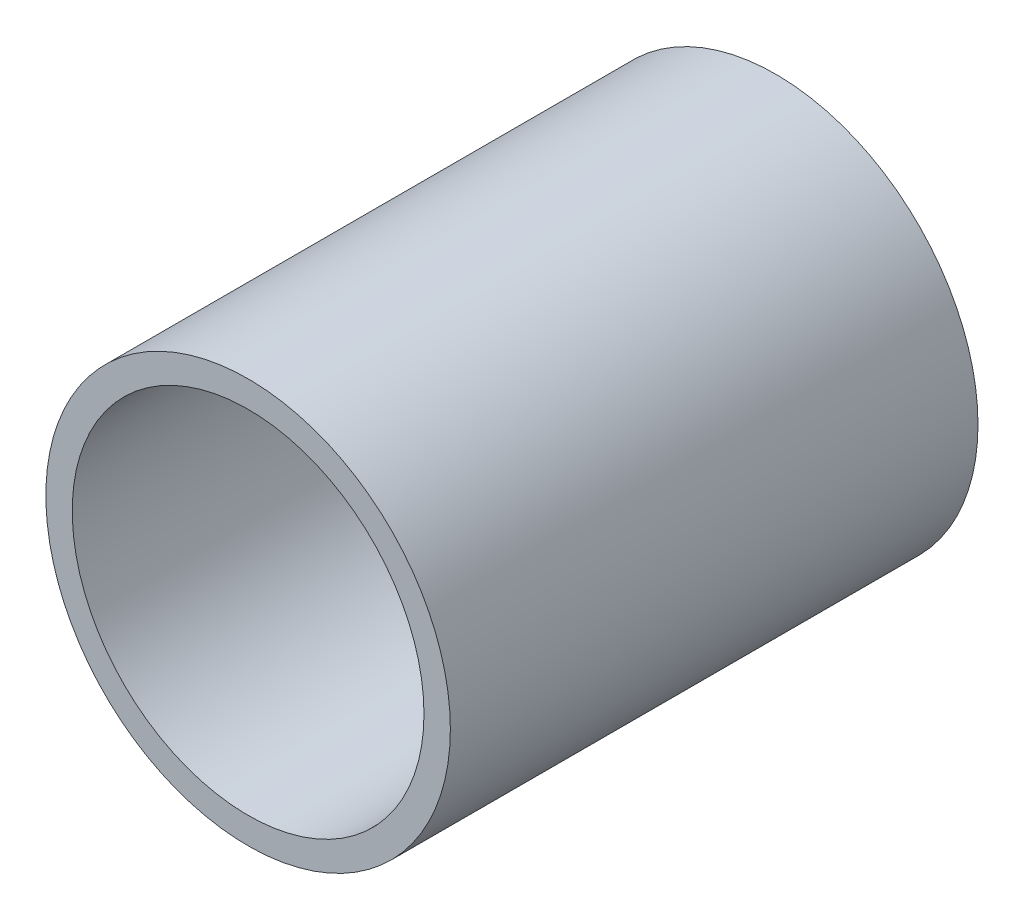
ISO-10303-21;
HEADER;
FILE_DESCRIPTION(('STEP AP214'),'2;1');
FILE_NAME('part.step','',(''),(''),'','','');
FILE_SCHEMA(('AUTOMOTIVE_DESIGN { 1 0 10303 214 1 1 1 1 }'));
ENDSEC;
DATA;
#1=APPLICATION_CONTEXT('core data for automotive mechanical design processes');
#2=APPLICATION_PROTOCOL_DEFINITION('international standard','automotive_design',2000,#1);
#3=PRODUCT_CONTEXT('',#1,'mechanical');
#4=PRODUCT('Part','Part','',(#3));
#5=PRODUCT_RELATED_PRODUCT_CATEGORY('part','',(#4));
#6=PRODUCT_DEFINITION_FORMATION('','',#4);
#7=PRODUCT_DEFINITION_CONTEXT('part definition',#1,'design');
#8=PRODUCT_DEFINITION('design','',#6,#7);
#9=PRODUCT_DEFINITION_SHAPE('','',#8);
#10=(LENGTH_UNIT() NAMED_UNIT(*) SI_UNIT(.MILLI.,.METRE.));
#11=(NAMED_UNIT(*) PLANE_ANGLE_UNIT() SI_UNIT($,.RADIAN.));
#12=(NAMED_UNIT(*) SI_UNIT($,.STERADIAN.) SOLID_ANGLE_UNIT());
#13=UNCERTAINTY_MEASURE_WITH_UNIT(LENGTH_MEASURE(1.E-05),#10,'distance_accuracy_value','');
#14=(GEOMETRIC_REPRESENTATION_CONTEXT(3) GLOBAL_UNCERTAINTY_ASSIGNED_CONTEXT((#13)) GLOBAL_UNIT_ASSIGNED_CONTEXT((#10,
#11,#12)) REPRESENTATION_CONTEXT('',''));
#15=CARTESIAN_POINT('',(0.,0.,0.));
#16=DIRECTION('',(0.,0.,1.));
#17=DIRECTION('',(1.,0.,0.));
#18=AXIS2_PLACEMENT_3D('',#15,#16,#17);
#19=CARTESIAN_POINT('',(0.,0.,15.));
#20=DIRECTION('',(0.,0.,1.));
#21=DIRECTION('',(1.,0.,0.));
#22=AXIS2_PLACEMENT_3D('',#19,#20,#21);
#23=PLANE('',#22);
#24=CARTESIAN_POINT('',(0.,0.,15.));
#25=DIRECTION('',(0.,0.,1.));
#26=DIRECTION('',(1.,0.,0.));
#27=AXIS2_PLACEMENT_3D('',#24,#25,#26);
#28=CIRCLE('',#27,11.5);
#29=CARTESIAN_POINT('',(11.5,0.,15.));
#30=VERTEX_POINT('',#29);
#31=EDGE_CURVE('E10',#30,#30,#28,.T.);
#32=ORIENTED_EDGE('',*,*,#31,.T.);
#33=EDGE_LOOP('',(#32));
#34=FACE_BOUND('',#33,.T.);
#35=CARTESIAN_POINT('',(0.,0.,15.));
#36=DIRECTION('',(0.,0.,1.));
#37=DIRECTION('',(1.,0.,0.));
#38=AXIS2_PLACEMENT_3D('',#35,#36,#37);
#39=CIRCLE('',#38,10.);
#40=CARTESIAN_POINT('',(10.,0.,15.));
#41=VERTEX_POINT('',#40);
#42=EDGE_CURVE('E46',#41,#41,#39,.T.);
#43=ORIENTED_EDGE('',*,*,#42,.F.);
#44=EDGE_LOOP('',(#43));
#45=FACE_BOUND('',#44,.T.);
#46=ADVANCED_FACE('F35',(#34,#45),#23,.T.);
#47=CARTESIAN_POINT('',(0.,0.,-15.));
#48=DIRECTION('',(0.,0.,1.));
#49=DIRECTION('',(1.,0.,0.));
#50=AXIS2_PLACEMENT_3D('',#47,#48,#49);
#51=PLANE('',#50);
#52=CARTESIAN_POINT('',(0.,0.,-15.));
#53=DIRECTION('',(0.,0.,1.));
#54=DIRECTION('',(1.,0.,0.));
#55=AXIS2_PLACEMENT_3D('',#52,#53,#54);
#56=CIRCLE('',#55,11.5);
#57=CARTESIAN_POINT('',(11.5,0.,-15.));
#58=VERTEX_POINT('',#57);
#59=EDGE_CURVE('E39',#58,#58,#56,.T.);
#60=ORIENTED_EDGE('',*,*,#59,.F.);
#61=EDGE_LOOP('',(#60));
#62=FACE_BOUND('',#61,.T.);
#63=CARTESIAN_POINT('',(0.,0.,-15.));
#64=DIRECTION('',(0.,0.,1.));
#65=DIRECTION('',(1.,0.,0.));
#66=AXIS2_PLACEMENT_3D('',#63,#64,#65);
#67=CIRCLE('',#66,10.);
#68=CARTESIAN_POINT('',(10.,0.,-15.));
#69=VERTEX_POINT('',#68);
#70=EDGE_CURVE('E48',#69,#69,#67,.T.);
#71=ORIENTED_EDGE('',*,*,#70,.T.);
#72=EDGE_LOOP('',(#71));
#73=FACE_BOUND('',#72,.T.);
#74=ADVANCED_FACE('F58',(#62,#73),#51,.F.);
#75=CARTESIAN_POINT('',(0.,0.,15.));
#76=DIRECTION('',(0.,0.,-1.));
#77=DIRECTION('',(-1.,0.,0.));
#78=AXIS2_PLACEMENT_3D('',#75,#76,#77);
#79=CYLINDRICAL_SURFACE('',#78,11.5);
#80=ORIENTED_EDGE('',*,*,#31,.F.);
#81=EDGE_LOOP('',(#80));
#82=FACE_BOUND('',#81,.T.);
#83=ORIENTED_EDGE('',*,*,#59,.T.);
#84=EDGE_LOOP('',(#83));
#85=FACE_BOUND('',#84,.T.);
#86=ADVANCED_FACE('F37',(#82,#85),#79,.T.);
#87=CARTESIAN_POINT('',(0.,0.,15.));
#88=DIRECTION('',(0.,0.,-1.));
#89=DIRECTION('',(-1.,0.,0.));
#90=AXIS2_PLACEMENT_3D('',#87,#88,#89);
#91=CYLINDRICAL_SURFACE('',#90,10.);
#92=ORIENTED_EDGE('',*,*,#42,.T.);
#93=EDGE_LOOP('',(#92));
#94=FACE_BOUND('',#93,.T.);
#95=ORIENTED_EDGE('',*,*,#70,.F.);
#96=EDGE_LOOP('',(#95));
#97=FACE_BOUND('',#96,.T.);
#98=ADVANCED_FACE('F54',(#94,#97),#91,.F.);
#99=CLOSED_SHELL('',(#46,#74,#86,#98));
#100=MANIFOLD_SOLID_BREP('B2',#99);
#101=ADVANCED_BREP_SHAPE_REPRESENTATION('',(#18,#100),#14);
#102=SHAPE_DEFINITION_REPRESENTATION(#9,#101);
ENDSEC;
END-ISO-10303-21;
